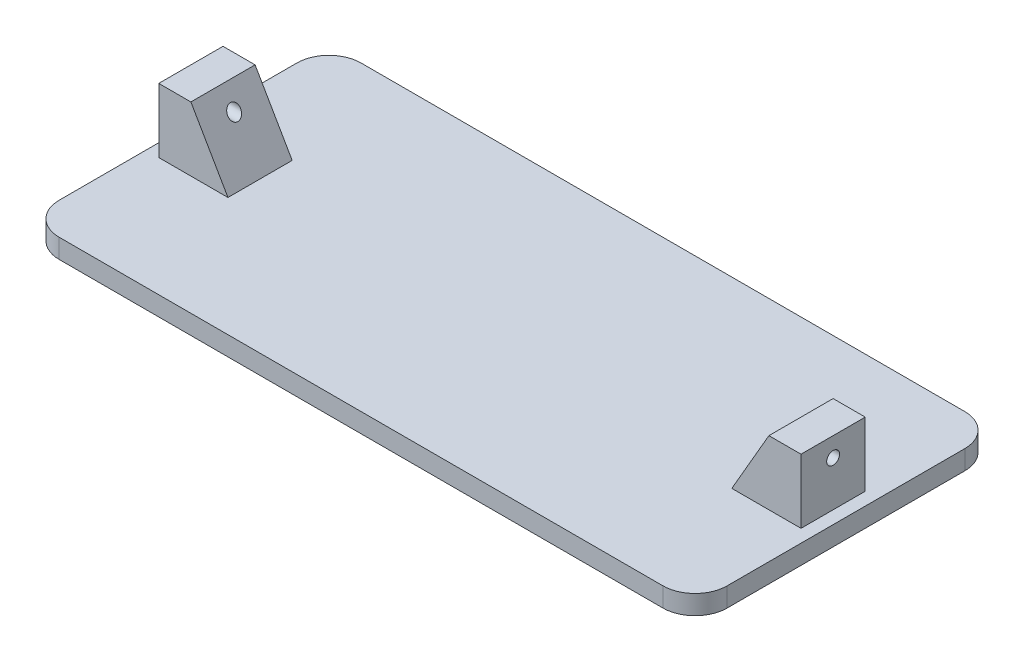
ISO-10303-21;
HEADER;
FILE_DESCRIPTION(('STEP AP214'),'2;1');
FILE_NAME('part.step','',(''),(''),'','','');
FILE_SCHEMA(('AUTOMOTIVE_DESIGN { 1 0 10303 214 1 1 1 1 }'));
ENDSEC;
DATA;
#1=APPLICATION_CONTEXT('core data for automotive mechanical design processes');
#2=APPLICATION_PROTOCOL_DEFINITION('international standard','automotive_design',2000,#1);
#3=PRODUCT_CONTEXT('',#1,'mechanical');
#4=PRODUCT('Part','Part','',(#3));
#5=PRODUCT_RELATED_PRODUCT_CATEGORY('part','',(#4));
#6=PRODUCT_DEFINITION_FORMATION('','',#4);
#7=PRODUCT_DEFINITION_CONTEXT('part definition',#1,'design');
#8=PRODUCT_DEFINITION('design','',#6,#7);
#9=PRODUCT_DEFINITION_SHAPE('','',#8);
#10=(LENGTH_UNIT() NAMED_UNIT(*) SI_UNIT(.MILLI.,.METRE.));
#11=(NAMED_UNIT(*) PLANE_ANGLE_UNIT() SI_UNIT($,.RADIAN.));
#12=(NAMED_UNIT(*) SI_UNIT($,.STERADIAN.) SOLID_ANGLE_UNIT());
#13=UNCERTAINTY_MEASURE_WITH_UNIT(LENGTH_MEASURE(1.E-05),#10,'distance_accuracy_value','');
#14=(GEOMETRIC_REPRESENTATION_CONTEXT(3) GLOBAL_UNCERTAINTY_ASSIGNED_CONTEXT((#13)) GLOBAL_UNIT_ASSIGNED_CONTEXT((#10,
#11,#12)) REPRESENTATION_CONTEXT('',''));
#15=CARTESIAN_POINT('',(0.,0.,0.));
#16=DIRECTION('',(0.,0.,1.));
#17=DIRECTION('',(1.,0.,0.));
#18=AXIS2_PLACEMENT_3D('',#15,#16,#17);
#19=CARTESIAN_POINT('',(-50.,3.,16.5));
#20=DIRECTION('',(1.,0.,0.));
#21=DIRECTION('',(0.,0.,-1.));
#22=AXIS2_PLACEMENT_3D('',#19,#20,#21);
#23=PLANE('',#22);
#24=CARTESIAN_POINT('',(-50.,10.,0.));
#25=DIRECTION('',(-1.,0.,0.));
#26=DIRECTION('',(0.,0.,1.));
#27=AXIS2_PLACEMENT_3D('',#24,#25,#26);
#28=CIRCLE('',#27,1.);
#29=CARTESIAN_POINT('',(-50.,10.,1.));
#30=VERTEX_POINT('',#29);
#31=EDGE_CURVE('E220',#30,#30,#28,.T.);
#32=ORIENTED_EDGE('',*,*,#31,.F.);
#33=EDGE_LOOP('',(#32));
#34=FACE_BOUND('',#33,.T.);
#35=DIRECTION('',(0.,0.,-1.));
#36=VECTOR('',#35,1.);
#37=CARTESIAN_POINT('',(-50.,3.,0.));
#38=LINE('',#37,#36);
#39=CARTESIAN_POINT('',(-50.,3.,5.));
#40=VERTEX_POINT('',#39);
#41=CARTESIAN_POINT('',(-50.,3.,-5.));
#42=VERTEX_POINT('',#41);
#43=EDGE_CURVE('E182',#40,#42,#38,.T.);
#44=ORIENTED_EDGE('',*,*,#43,.F.);
#45=DIRECTION('',(0.,1.,0.));
#46=VECTOR('',#45,1.);
#47=CARTESIAN_POINT('',(-50.,0.,5.));
#48=LINE('',#47,#46);
#49=CARTESIAN_POINT('',(-50.,13.,5.));
#50=VERTEX_POINT('',#49);
#51=EDGE_CURVE('E274',#40,#50,#48,.T.);
#52=ORIENTED_EDGE('',*,*,#51,.T.);
#53=DIRECTION('',(0.,0.,-1.));
#54=VECTOR('',#53,1.);
#55=CARTESIAN_POINT('',(-50.,13.,5.));
#56=LINE('',#55,#54);
#57=CARTESIAN_POINT('',(-50.,13.,-5.));
#58=VERTEX_POINT('',#57);
#59=EDGE_CURVE('E53',#50,#58,#56,.T.);
#60=ORIENTED_EDGE('',*,*,#59,.T.);
#61=DIRECTION('',(0.,1.,0.));
#62=VECTOR('',#61,1.);
#63=CARTESIAN_POINT('',(-50.,0.,-5.));
#64=LINE('',#63,#62);
#65=EDGE_CURVE('E270',#42,#58,#64,.T.);
#66=ORIENTED_EDGE('',*,*,#65,.F.);
#67=EDGE_LOOP('',(#44,#52,#60,#66));
#68=FACE_BOUND('',#67,.T.);
#69=ADVANCED_FACE('F36',(#34,#68),#23,.F.);
#70=CARTESIAN_POINT('',(50.,3.,16.5));
#71=DIRECTION('',(-1.,0.,0.));
#72=DIRECTION('',(0.,0.,1.));
#73=AXIS2_PLACEMENT_3D('',#70,#71,#72);
#74=PLANE('',#73);
#75=CARTESIAN_POINT('',(50.,10.,0.));
#76=DIRECTION('',(-1.,0.,0.));
#77=DIRECTION('',(0.,0.,1.));
#78=AXIS2_PLACEMENT_3D('',#75,#76,#77);
#79=CIRCLE('',#78,1.);
#80=CARTESIAN_POINT('',(50.,10.,1.));
#81=VERTEX_POINT('',#80);
#82=EDGE_CURVE('E232',#81,#81,#79,.T.);
#83=ORIENTED_EDGE('',*,*,#82,.T.);
#84=EDGE_LOOP('',(#83));
#85=FACE_BOUND('',#84,.T.);
#86=DIRECTION('',(0.,0.,1.));
#87=VECTOR('',#86,1.);
#88=CARTESIAN_POINT('',(50.,3.,0.));
#89=LINE('',#88,#87);
#90=CARTESIAN_POINT('',(50.,3.,-5.));
#91=VERTEX_POINT('',#90);
#92=CARTESIAN_POINT('',(50.,3.,5.));
#93=VERTEX_POINT('',#92);
#94=EDGE_CURVE('E180',#91,#93,#89,.T.);
#95=ORIENTED_EDGE('',*,*,#94,.F.);
#96=DIRECTION('',(0.,1.,0.));
#97=VECTOR('',#96,1.);
#98=CARTESIAN_POINT('',(50.,-1.38777878078144E-13,-5.));
#99=LINE('',#98,#97);
#100=CARTESIAN_POINT('',(50.,13.,-5.));
#101=VERTEX_POINT('',#100);
#102=EDGE_CURVE('E254',#91,#101,#99,.T.);
#103=ORIENTED_EDGE('',*,*,#102,.T.);
#104=DIRECTION('',(0.,0.,-1.));
#105=VECTOR('',#104,1.);
#106=CARTESIAN_POINT('',(50.,13.,5.));
#107=LINE('',#106,#105);
#108=CARTESIAN_POINT('',(50.,13.,5.));
#109=VERTEX_POINT('',#108);
#110=EDGE_CURVE('E264',#109,#101,#107,.T.);
#111=ORIENTED_EDGE('',*,*,#110,.F.);
#112=DIRECTION('',(0.,1.,0.));
#113=VECTOR('',#112,1.);
#114=CARTESIAN_POINT('',(50.,-1.38777878078144E-13,5.));
#115=LINE('',#114,#113);
#116=EDGE_CURVE('E244',#93,#109,#115,.T.);
#117=ORIENTED_EDGE('',*,*,#116,.F.);
#118=EDGE_LOOP('',(#95,#103,#111,#117));
#119=FACE_BOUND('',#118,.T.);
#120=ADVANCED_FACE('F307',(#85,#119),#74,.F.);
#121=CARTESIAN_POINT('',(45.,3.,-16.5));
#122=DIRECTION('',(0.,1.,0.));
#123=DIRECTION('',(0.,0.,1.));
#124=AXIS2_PLACEMENT_3D('',#121,#122,#123);
#125=PLANE('',#124);
#126=ORIENTED_EDGE('',*,*,#94,.T.);
#127=DIRECTION('',(-1.,0.,0.));
#128=VECTOR('',#127,1.);
#129=CARTESIAN_POINT('',(0.,3.,5.));
#130=LINE('',#129,#128);
#131=CARTESIAN_POINT('',(39.2264973081037,3.00000000000002,5.));
#132=VERTEX_POINT('',#131);
#133=EDGE_CURVE('E241',#93,#132,#130,.T.);
#134=ORIENTED_EDGE('',*,*,#133,.T.);
#135=DIRECTION('',(0.,0.,-1.));
#136=VECTOR('',#135,1.);
#137=CARTESIAN_POINT('',(39.2264973081037,3.00000000000002,5.));
#138=LINE('',#137,#136);
#139=CARTESIAN_POINT('',(39.2264973081037,3.00000000000002,-5.));
#140=VERTEX_POINT('',#139);
#141=EDGE_CURVE('E251',#132,#140,#138,.T.);
#142=ORIENTED_EDGE('',*,*,#141,.T.);
#143=DIRECTION('',(-1.,0.,0.));
#144=VECTOR('',#143,1.);
#145=CARTESIAN_POINT('',(0.,3.,-5.));
#146=LINE('',#145,#144);
#147=EDGE_CURVE('E240',#91,#140,#146,.T.);
#148=ORIENTED_EDGE('',*,*,#147,.F.);
#149=EDGE_LOOP('',(#126,#134,#142,#148));
#150=FACE_BOUND('',#149,.T.);
#151=ORIENTED_EDGE('',*,*,#43,.T.);
#152=DIRECTION('',(-1.,0.,0.));
#153=VECTOR('',#152,1.);
#154=CARTESIAN_POINT('',(0.,3.00000000000012,-5.));
#155=LINE('',#154,#153);
#156=CARTESIAN_POINT('',(-39.2264973081037,3.00000000000002,-5.));
#157=VERTEX_POINT('',#156);
#158=EDGE_CURVE('E267',#157,#42,#155,.T.);
#159=ORIENTED_EDGE('',*,*,#158,.F.);
#160=DIRECTION('',(0.,0.,-1.));
#161=VECTOR('',#160,1.);
#162=CARTESIAN_POINT('',(-39.2264973081037,3.00000000000002,5.));
#163=LINE('',#162,#161);
#164=CARTESIAN_POINT('',(-39.2264973081037,3.00000000000002,5.));
#165=VERTEX_POINT('',#164);
#166=EDGE_CURVE('E11',#165,#157,#163,.T.);
#167=ORIENTED_EDGE('',*,*,#166,.F.);
#168=DIRECTION('',(-1.,0.,0.));
#169=VECTOR('',#168,1.);
#170=CARTESIAN_POINT('',(0.,3.00000000000012,5.));
#171=LINE('',#170,#169);
#172=EDGE_CURVE('E73',#165,#40,#171,.T.);
#173=ORIENTED_EDGE('',*,*,#172,.T.);
#174=EDGE_LOOP('',(#151,#159,#167,#173));
#175=FACE_BOUND('',#174,.T.);
#176=DIRECTION('',(0.,0.,-1.));
#177=VECTOR('',#176,1.);
#178=CARTESIAN_POINT('',(-52.,3.,0.));
#179=LINE('',#178,#177);
#180=CARTESIAN_POINT('',(-52.,3.,18.5));
#181=VERTEX_POINT('',#180);
#182=CARTESIAN_POINT('',(-52.,3.,-18.5));
#183=VERTEX_POINT('',#182);
#184=EDGE_CURVE('E173',#181,#183,#179,.T.);
#185=ORIENTED_EDGE('',*,*,#184,.F.);
#186=CARTESIAN_POINT('',(-47.,3.,18.5));
#187=DIRECTION('',(0.,-1.,0.));
#188=DIRECTION('',(0.,0.,-1.));
#189=AXIS2_PLACEMENT_3D('',#186,#187,#188);
#190=CIRCLE('',#189,5.);
#191=CARTESIAN_POINT('',(-47.,3.,23.5));
#192=VERTEX_POINT('',#191);
#193=EDGE_CURVE('E166',#192,#181,#190,.T.);
#194=ORIENTED_EDGE('',*,*,#193,.F.);
#195=DIRECTION('',(1.,0.,0.));
#196=VECTOR('',#195,1.);
#197=CARTESIAN_POINT('',(0.,3.,23.5));
#198=LINE('',#197,#196);
#199=CARTESIAN_POINT('',(47.,3.,23.5));
#200=VERTEX_POINT('',#199);
#201=EDGE_CURVE('E195',#192,#200,#198,.T.);
#202=ORIENTED_EDGE('',*,*,#201,.T.);
#203=CARTESIAN_POINT('',(47.,3.,18.5));
#204=DIRECTION('',(0.,-1.,0.));
#205=DIRECTION('',(0.,0.,-1.));
#206=AXIS2_PLACEMENT_3D('',#203,#204,#205);
#207=CIRCLE('',#206,5.);
#208=CARTESIAN_POINT('',(52.,3.,18.5));
#209=VERTEX_POINT('',#208);
#210=EDGE_CURVE('E192',#209,#200,#207,.T.);
#211=ORIENTED_EDGE('',*,*,#210,.F.);
#212=DIRECTION('',(0.,0.,1.));
#213=VECTOR('',#212,1.);
#214=CARTESIAN_POINT('',(52.,3.,0.));
#215=LINE('',#214,#213);
#216=CARTESIAN_POINT('',(52.,3.,-18.5));
#217=VERTEX_POINT('',#216);
#218=EDGE_CURVE('E189',#217,#209,#215,.T.);
#219=ORIENTED_EDGE('',*,*,#218,.F.);
#220=CARTESIAN_POINT('',(47.,3.,-18.5));
#221=DIRECTION('',(0.,-1.,0.));
#222=DIRECTION('',(0.,0.,-1.));
#223=AXIS2_PLACEMENT_3D('',#220,#221,#222);
#224=CIRCLE('',#223,5.);
#225=CARTESIAN_POINT('',(47.,3.,-23.5));
#226=VERTEX_POINT('',#225);
#227=EDGE_CURVE('E187',#217,#226,#224,.F.);
#228=ORIENTED_EDGE('',*,*,#227,.T.);
#229=DIRECTION('',(1.,0.,0.));
#230=VECTOR('',#229,1.);
#231=CARTESIAN_POINT('',(0.,3.,-23.5));
#232=LINE('',#231,#230);
#233=CARTESIAN_POINT('',(-47.,3.,-23.5));
#234=VERTEX_POINT('',#233);
#235=EDGE_CURVE('E176',#234,#226,#232,.T.);
#236=ORIENTED_EDGE('',*,*,#235,.F.);
#237=CARTESIAN_POINT('',(-47.,3.,-18.5));
#238=DIRECTION('',(0.,-1.,0.));
#239=DIRECTION('',(0.,0.,-1.));
#240=AXIS2_PLACEMENT_3D('',#237,#238,#239);
#241=CIRCLE('',#240,5.);
#242=EDGE_CURVE('E158',#183,#234,#241,.T.);
#243=ORIENTED_EDGE('',*,*,#242,.F.);
#244=EDGE_LOOP('',(#185,#194,#202,#211,#219,#228,#236,#243));
#245=FACE_BOUND('',#244,.T.);
#246=ADVANCED_FACE('F171',(#150,#175,#245),#125,.T.);
#247=CARTESIAN_POINT('',(-28.1208348754009,-16.2355715851499,5.));
#248=DIRECTION('',(0.866025403784436,0.500000000000004,0.));
#249=DIRECTION('',(-0.500000000000004,0.866025403784436,0.));
#250=AXIS2_PLACEMENT_3D('',#247,#248,#249);
#251=PLANE('',#250);
#252=CARTESIAN_POINT('',(-43.2679491924311,10.,0.));
#253=DIRECTION('',(0.866025403784436,0.500000000000004,0.));
#254=DIRECTION('',(-0.500000000000004,0.866025403784436,0.));
#255=AXIS2_PLACEMENT_3D('',#252,#253,#254);
#256=ELLIPSE('',#255,1.15470053837926,1.);
#257=CARTESIAN_POINT('',(-43.8452994616207,11.,0.));
#258=VERTEX_POINT('',#257);
#259=EDGE_CURVE('E237',#258,#258,#256,.T.);
#260=ORIENTED_EDGE('',*,*,#259,.F.);
#261=EDGE_LOOP('',(#260));
#262=FACE_BOUND('',#261,.T.);
#263=DIRECTION('',(0.500000000000004,-0.866025403784436,0.));
#264=VECTOR('',#263,1.);
#265=CARTESIAN_POINT('',(-28.1208348754009,-16.2355715851499,-5.));
#266=LINE('',#265,#264);
#267=CARTESIAN_POINT('',(-45.,13.,-5.));
#268=VERTEX_POINT('',#267);
#269=EDGE_CURVE('E278',#268,#157,#266,.T.);
#270=ORIENTED_EDGE('',*,*,#269,.F.);
#271=DIRECTION('',(0.,0.,-1.));
#272=VECTOR('',#271,1.);
#273=CARTESIAN_POINT('',(-45.,13.,5.));
#274=LINE('',#273,#272);
#275=CARTESIAN_POINT('',(-45.,13.,5.));
#276=VERTEX_POINT('',#275);
#277=EDGE_CURVE('E45',#276,#268,#274,.T.);
#278=ORIENTED_EDGE('',*,*,#277,.F.);
#279=DIRECTION('',(0.500000000000004,-0.866025403784436,0.));
#280=VECTOR('',#279,1.);
#281=CARTESIAN_POINT('',(-28.1208348754009,-16.2355715851499,5.));
#282=LINE('',#281,#280);
#283=EDGE_CURVE('E269',#276,#165,#282,.T.);
#284=ORIENTED_EDGE('',*,*,#283,.T.);
#285=ORIENTED_EDGE('',*,*,#166,.T.);
#286=EDGE_LOOP('',(#270,#278,#284,#285));
#287=FACE_BOUND('',#286,.T.);
#288=ADVANCED_FACE('F294',(#262,#287),#251,.T.);
#289=CARTESIAN_POINT('',(0.,13.,5.));
#290=DIRECTION('',(0.,1.,0.));
#291=DIRECTION('',(0.,0.,1.));
#292=AXIS2_PLACEMENT_3D('',#289,#290,#291);
#293=PLANE('',#292);
#294=DIRECTION('',(1.,0.,0.));
#295=VECTOR('',#294,1.);
#296=CARTESIAN_POINT('',(0.,13.,-5.));
#297=LINE('',#296,#295);
#298=EDGE_CURVE('E281',#58,#268,#297,.T.);
#299=ORIENTED_EDGE('',*,*,#298,.F.);
#300=ORIENTED_EDGE('',*,*,#59,.F.);
#301=DIRECTION('',(1.,0.,0.));
#302=VECTOR('',#301,1.);
#303=CARTESIAN_POINT('',(0.,13.,5.));
#304=LINE('',#303,#302);
#305=EDGE_CURVE('E272',#50,#276,#304,.T.);
#306=ORIENTED_EDGE('',*,*,#305,.T.);
#307=ORIENTED_EDGE('',*,*,#277,.T.);
#308=EDGE_LOOP('',(#299,#300,#306,#307));
#309=FACE_BOUND('',#308,.T.);
#310=ADVANCED_FACE('F295',(#309),#293,.T.);
#311=CARTESIAN_POINT('',(0.,0.,5.));
#312=DIRECTION('',(0.,0.,1.));
#313=DIRECTION('',(1.,0.,0.));
#314=AXIS2_PLACEMENT_3D('',#311,#312,#313);
#315=PLANE('',#314);
#316=ORIENTED_EDGE('',*,*,#172,.F.);
#317=ORIENTED_EDGE('',*,*,#283,.F.);
#318=ORIENTED_EDGE('',*,*,#305,.F.);
#319=ORIENTED_EDGE('',*,*,#51,.F.);
#320=EDGE_LOOP('',(#316,#317,#318,#319));
#321=FACE_BOUND('',#320,.T.);
#322=ADVANCED_FACE('F291',(#321),#315,.T.);
#323=CARTESIAN_POINT('',(0.,0.,-5.));
#324=DIRECTION('',(0.,0.,1.));
#325=DIRECTION('',(1.,0.,0.));
#326=AXIS2_PLACEMENT_3D('',#323,#324,#325);
#327=PLANE('',#326);
#328=ORIENTED_EDGE('',*,*,#158,.T.);
#329=ORIENTED_EDGE('',*,*,#65,.T.);
#330=ORIENTED_EDGE('',*,*,#298,.T.);
#331=ORIENTED_EDGE('',*,*,#269,.T.);
#332=EDGE_LOOP('',(#328,#329,#330,#331));
#333=FACE_BOUND('',#332,.T.);
#334=ADVANCED_FACE('F288',(#333),#327,.F.);
#335=CARTESIAN_POINT('',(0.,13.,5.));
#336=DIRECTION('',(0.,-1.,0.));
#337=DIRECTION('',(1.,0.,0.));
#338=AXIS2_PLACEMENT_3D('',#335,#336,#337);
#339=PLANE('',#338);
#340=DIRECTION('',(-1.,0.,0.));
#341=VECTOR('',#340,1.);
#342=CARTESIAN_POINT('',(0.,13.,-5.));
#343=LINE('',#342,#341);
#344=CARTESIAN_POINT('',(45.,13.,-5.));
#345=VERTEX_POINT('',#344);
#346=EDGE_CURVE('E256',#101,#345,#343,.T.);
#347=ORIENTED_EDGE('',*,*,#346,.T.);
#348=DIRECTION('',(0.,0.,-1.));
#349=VECTOR('',#348,1.);
#350=CARTESIAN_POINT('',(45.,13.,5.));
#351=LINE('',#350,#349);
#352=CARTESIAN_POINT('',(45.,13.,5.));
#353=VERTEX_POINT('',#352);
#354=EDGE_CURVE('E261',#353,#345,#351,.T.);
#355=ORIENTED_EDGE('',*,*,#354,.F.);
#356=DIRECTION('',(-1.,0.,0.));
#357=VECTOR('',#356,1.);
#358=CARTESIAN_POINT('',(0.,13.,5.));
#359=LINE('',#358,#357);
#360=EDGE_CURVE('E247',#109,#353,#359,.T.);
#361=ORIENTED_EDGE('',*,*,#360,.F.);
#362=ORIENTED_EDGE('',*,*,#110,.T.);
#363=EDGE_LOOP('',(#347,#355,#361,#362));
#364=FACE_BOUND('',#363,.T.);
#365=ADVANCED_FACE('F340',(#364),#339,.F.);
#366=CARTESIAN_POINT('',(28.120834875401,-16.2355715851499,5.));
#367=DIRECTION('',(0.866025403784436,-0.500000000000004,0.));
#368=DIRECTION('',(0.500000000000004,0.866025403784436,0.));
#369=AXIS2_PLACEMENT_3D('',#366,#367,#368);
#370=PLANE('',#369);
#371=CARTESIAN_POINT('',(43.2679491924311,10.,0.));
#372=DIRECTION('',(0.866025403784436,-0.500000000000004,0.));
#373=DIRECTION('',(-0.500000000000004,-0.866025403784436,0.));
#374=AXIS2_PLACEMENT_3D('',#371,#372,#373);
#375=ELLIPSE('',#374,1.15470053837926,1.);
#376=CARTESIAN_POINT('',(42.6905989232415,9.,0.));
#377=VERTEX_POINT('',#376);
#378=EDGE_CURVE('E39',#377,#377,#375,.T.);
#379=ORIENTED_EDGE('',*,*,#378,.T.);
#380=EDGE_LOOP('',(#379));
#381=FACE_BOUND('',#380,.T.);
#382=DIRECTION('',(-0.500000000000004,-0.866025403784436,0.));
#383=VECTOR('',#382,1.);
#384=CARTESIAN_POINT('',(28.120834875401,-16.2355715851499,-5.));
#385=LINE('',#384,#383);
#386=EDGE_CURVE('E245',#345,#140,#385,.T.);
#387=ORIENTED_EDGE('',*,*,#386,.T.);
#388=ORIENTED_EDGE('',*,*,#141,.F.);
#389=DIRECTION('',(-0.500000000000004,-0.866025403784436,0.));
#390=VECTOR('',#389,1.);
#391=CARTESIAN_POINT('',(28.120834875401,-16.2355715851499,5.));
#392=LINE('',#391,#390);
#393=EDGE_CURVE('E249',#353,#132,#392,.T.);
#394=ORIENTED_EDGE('',*,*,#393,.F.);
#395=ORIENTED_EDGE('',*,*,#354,.T.);
#396=EDGE_LOOP('',(#387,#388,#394,#395));
#397=FACE_BOUND('',#396,.T.);
#398=ADVANCED_FACE('F333',(#381,#397),#370,.F.);
#399=CARTESIAN_POINT('',(0.,0.,5.));
#400=DIRECTION('',(0.,0.,1.));
#401=DIRECTION('',(1.,0.,0.));
#402=AXIS2_PLACEMENT_3D('',#399,#400,#401);
#403=PLANE('',#402);
#404=ORIENTED_EDGE('',*,*,#133,.F.);
#405=ORIENTED_EDGE('',*,*,#116,.T.);
#406=ORIENTED_EDGE('',*,*,#360,.T.);
#407=ORIENTED_EDGE('',*,*,#393,.T.);
#408=EDGE_LOOP('',(#404,#405,#406,#407));
#409=FACE_BOUND('',#408,.T.);
#410=ADVANCED_FACE('F330',(#409),#403,.T.);
#411=CARTESIAN_POINT('',(0.,0.,-5.));
#412=DIRECTION('',(0.,0.,1.));
#413=DIRECTION('',(1.,0.,0.));
#414=AXIS2_PLACEMENT_3D('',#411,#412,#413);
#415=PLANE('',#414);
#416=ORIENTED_EDGE('',*,*,#147,.T.);
#417=ORIENTED_EDGE('',*,*,#386,.F.);
#418=ORIENTED_EDGE('',*,*,#346,.F.);
#419=ORIENTED_EDGE('',*,*,#102,.F.);
#420=EDGE_LOOP('',(#416,#417,#418,#419));
#421=FACE_BOUND('',#420,.T.);
#422=ADVANCED_FACE('F326',(#421),#415,.F.);
#423=CARTESIAN_POINT('',(50.,10.,0.));
#424=DIRECTION('',(-1.,0.,0.));
#425=DIRECTION('',(0.,0.,1.));
#426=AXIS2_PLACEMENT_3D('',#423,#424,#425);
#427=CYLINDRICAL_SURFACE('',#426,1.);
#428=ORIENTED_EDGE('',*,*,#82,.F.);
#429=EDGE_LOOP('',(#428));
#430=FACE_BOUND('',#429,.T.);
#431=ORIENTED_EDGE('',*,*,#378,.F.);
#432=EDGE_LOOP('',(#431));
#433=FACE_BOUND('',#432,.T.);
#434=ADVANCED_FACE('F317',(#430,#433),#427,.F.);
#435=ORIENTED_EDGE('',*,*,#259,.T.);
#436=EDGE_LOOP('',(#435));
#437=FACE_BOUND('',#436,.T.);
#438=ORIENTED_EDGE('',*,*,#31,.T.);
#439=EDGE_LOOP('',(#438));
#440=FACE_BOUND('',#439,.T.);
#441=ADVANCED_FACE('F315',(#437,#440),#427,.F.);
#442=CARTESIAN_POINT('',(-52.,3.,0.));
#443=DIRECTION('',(-1.,0.,0.));
#444=DIRECTION('',(0.,0.,1.));
#445=AXIS2_PLACEMENT_3D('',#442,#443,#444);
#446=PLANE('',#445);
#447=DIRECTION('',(0.,0.,-1.));
#448=VECTOR('',#447,1.);
#449=CARTESIAN_POINT('',(-52.,0.,0.));
#450=LINE('',#449,#448);
#451=CARTESIAN_POINT('',(-52.,0.,18.5));
#452=VERTEX_POINT('',#451);
#453=CARTESIAN_POINT('',(-52.,0.,-18.5));
#454=VERTEX_POINT('',#453);
#455=EDGE_CURVE('E198',#452,#454,#450,.T.);
#456=ORIENTED_EDGE('',*,*,#455,.F.);
#457=DIRECTION('',(0.,-1.,0.));
#458=VECTOR('',#457,1.);
#459=CARTESIAN_POINT('',(-52.,3.,18.5));
#460=LINE('',#459,#458);
#461=EDGE_CURVE('E179',#181,#452,#460,.T.);
#462=ORIENTED_EDGE('',*,*,#461,.F.);
#463=ORIENTED_EDGE('',*,*,#184,.T.);
#464=DIRECTION('',(0.,-1.,0.));
#465=VECTOR('',#464,1.);
#466=CARTESIAN_POINT('',(-52.,3.,-18.5));
#467=LINE('',#466,#465);
#468=EDGE_CURVE('E155',#183,#454,#467,.T.);
#469=ORIENTED_EDGE('',*,*,#468,.T.);
#470=EDGE_LOOP('',(#456,#462,#463,#469));
#471=FACE_BOUND('',#470,.T.);
#472=ADVANCED_FACE('F178',(#471),#446,.T.);
#473=CARTESIAN_POINT('',(-47.,3.,18.5));
#474=DIRECTION('',(0.,-1.,0.));
#475=DIRECTION('',(0.,0.,-1.));
#476=AXIS2_PLACEMENT_3D('',#473,#474,#475);
#477=CYLINDRICAL_SURFACE('',#476,5.);
#478=CARTESIAN_POINT('',(-47.,0.,18.5));
#479=DIRECTION('',(0.,-1.,0.));
#480=DIRECTION('',(0.,0.,-1.));
#481=AXIS2_PLACEMENT_3D('',#478,#479,#480);
#482=CIRCLE('',#481,5.);
#483=CARTESIAN_POINT('',(-47.,0.,23.5));
#484=VERTEX_POINT('',#483);
#485=EDGE_CURVE('E216',#484,#452,#482,.T.);
#486=ORIENTED_EDGE('',*,*,#485,.F.);
#487=DIRECTION('',(0.,-1.,0.));
#488=VECTOR('',#487,1.);
#489=CARTESIAN_POINT('',(-47.,3.,23.5));
#490=LINE('',#489,#488);
#491=EDGE_CURVE('E221',#192,#484,#490,.T.);
#492=ORIENTED_EDGE('',*,*,#491,.F.);
#493=ORIENTED_EDGE('',*,*,#193,.T.);
#494=ORIENTED_EDGE('',*,*,#461,.T.);
#495=EDGE_LOOP('',(#486,#492,#493,#494));
#496=FACE_BOUND('',#495,.T.);
#497=ADVANCED_FACE('F324',(#496),#477,.T.);
#498=CARTESIAN_POINT('',(0.,3.,23.5));
#499=DIRECTION('',(0.,0.,-1.));
#500=DIRECTION('',(-1.,0.,0.));
#501=AXIS2_PLACEMENT_3D('',#498,#499,#500);
#502=PLANE('',#501);
#503=DIRECTION('',(1.,0.,0.));
#504=VECTOR('',#503,1.);
#505=CARTESIAN_POINT('',(0.,0.,23.5));
#506=LINE('',#505,#504);
#507=CARTESIAN_POINT('',(47.,0.,23.5));
#508=VERTEX_POINT('',#507);
#509=EDGE_CURVE('E213',#484,#508,#506,.T.);
#510=ORIENTED_EDGE('',*,*,#509,.T.);
#511=DIRECTION('',(0.,-1.,0.));
#512=VECTOR('',#511,1.);
#513=CARTESIAN_POINT('',(47.,3.,23.5));
#514=LINE('',#513,#512);
#515=EDGE_CURVE('E223',#200,#508,#514,.T.);
#516=ORIENTED_EDGE('',*,*,#515,.F.);
#517=ORIENTED_EDGE('',*,*,#201,.F.);
#518=ORIENTED_EDGE('',*,*,#491,.T.);
#519=EDGE_LOOP('',(#510,#516,#517,#518));
#520=FACE_BOUND('',#519,.T.);
#521=ADVANCED_FACE('F485',(#520),#502,.F.);
#522=CARTESIAN_POINT('',(47.,3.,18.5));
#523=DIRECTION('',(0.,-1.,0.));
#524=DIRECTION('',(0.,0.,-1.));
#525=AXIS2_PLACEMENT_3D('',#522,#523,#524);
#526=CYLINDRICAL_SURFACE('',#525,5.);
#527=CARTESIAN_POINT('',(47.,0.,18.5));
#528=DIRECTION('',(0.,-1.,0.));
#529=DIRECTION('',(0.,0.,-1.));
#530=AXIS2_PLACEMENT_3D('',#527,#528,#529);
#531=CIRCLE('',#530,5.);
#532=CARTESIAN_POINT('',(52.,0.,18.5));
#533=VERTEX_POINT('',#532);
#534=EDGE_CURVE('E210',#533,#508,#531,.T.);
#535=ORIENTED_EDGE('',*,*,#534,.F.);
#536=DIRECTION('',(0.,-1.,0.));
#537=VECTOR('',#536,1.);
#538=CARTESIAN_POINT('',(52.,3.,18.5));
#539=LINE('',#538,#537);
#540=EDGE_CURVE('E225',#209,#533,#539,.T.);
#541=ORIENTED_EDGE('',*,*,#540,.F.);
#542=ORIENTED_EDGE('',*,*,#210,.T.);
#543=ORIENTED_EDGE('',*,*,#515,.T.);
#544=EDGE_LOOP('',(#535,#541,#542,#543));
#545=FACE_BOUND('',#544,.T.);
#546=ADVANCED_FACE('F474',(#545),#526,.T.);
#547=CARTESIAN_POINT('',(52.,3.,0.));
#548=DIRECTION('',(1.,0.,0.));
#549=DIRECTION('',(0.,0.,-1.));
#550=AXIS2_PLACEMENT_3D('',#547,#548,#549);
#551=PLANE('',#550);
#552=DIRECTION('',(0.,0.,1.));
#553=VECTOR('',#552,1.);
#554=CARTESIAN_POINT('',(52.,0.,0.));
#555=LINE('',#554,#553);
#556=CARTESIAN_POINT('',(52.,0.,-18.5));
#557=VERTEX_POINT('',#556);
#558=EDGE_CURVE('E207',#557,#533,#555,.T.);
#559=ORIENTED_EDGE('',*,*,#558,.F.);
#560=DIRECTION('',(0.,-1.,0.));
#561=VECTOR('',#560,1.);
#562=CARTESIAN_POINT('',(52.,3.,-18.5));
#563=LINE('',#562,#561);
#564=EDGE_CURVE('E227',#217,#557,#563,.T.);
#565=ORIENTED_EDGE('',*,*,#564,.F.);
#566=ORIENTED_EDGE('',*,*,#218,.T.);
#567=ORIENTED_EDGE('',*,*,#540,.T.);
#568=EDGE_LOOP('',(#559,#565,#566,#567));
#569=FACE_BOUND('',#568,.T.);
#570=ADVANCED_FACE('F464',(#569),#551,.T.);
#571=CARTESIAN_POINT('',(47.,3.,-18.5));
#572=DIRECTION('',(0.,-1.,0.));
#573=DIRECTION('',(0.,0.,-1.));
#574=AXIS2_PLACEMENT_3D('',#571,#572,#573);
#575=CYLINDRICAL_SURFACE('',#574,5.);
#576=CARTESIAN_POINT('',(47.,0.,-18.5));
#577=DIRECTION('',(0.,-1.,0.));
#578=DIRECTION('',(0.,0.,-1.));
#579=AXIS2_PLACEMENT_3D('',#576,#577,#578);
#580=CIRCLE('',#579,5.);
#581=CARTESIAN_POINT('',(47.,0.,-23.5));
#582=VERTEX_POINT('',#581);
#583=EDGE_CURVE('E204',#557,#582,#580,.F.);
#584=ORIENTED_EDGE('',*,*,#583,.T.);
#585=DIRECTION('',(0.,-1.,0.));
#586=VECTOR('',#585,1.);
#587=CARTESIAN_POINT('',(47.,3.,-23.5));
#588=LINE('',#587,#586);
#589=EDGE_CURVE('E229',#226,#582,#588,.T.);
#590=ORIENTED_EDGE('',*,*,#589,.F.);
#591=ORIENTED_EDGE('',*,*,#227,.F.);
#592=ORIENTED_EDGE('',*,*,#564,.T.);
#593=EDGE_LOOP('',(#584,#590,#591,#592));
#594=FACE_BOUND('',#593,.T.);
#595=ADVANCED_FACE('F451',(#594),#575,.T.);
#596=CARTESIAN_POINT('',(0.,3.,-23.5));
#597=DIRECTION('',(0.,0.,-1.));
#598=DIRECTION('',(-1.,0.,0.));
#599=AXIS2_PLACEMENT_3D('',#596,#597,#598);
#600=PLANE('',#599);
#601=DIRECTION('',(1.,0.,0.));
#602=VECTOR('',#601,1.);
#603=CARTESIAN_POINT('',(0.,0.,-23.5));
#604=LINE('',#603,#602);
#605=CARTESIAN_POINT('',(-47.,0.,-23.5));
#606=VERTEX_POINT('',#605);
#607=EDGE_CURVE('E201',#606,#582,#604,.T.);
#608=ORIENTED_EDGE('',*,*,#607,.F.);
#609=DIRECTION('',(0.,-1.,0.));
#610=VECTOR('',#609,1.);
#611=CARTESIAN_POINT('',(-47.,3.,-23.5));
#612=LINE('',#611,#610);
#613=EDGE_CURVE('E165',#234,#606,#612,.T.);
#614=ORIENTED_EDGE('',*,*,#613,.F.);
#615=ORIENTED_EDGE('',*,*,#235,.T.);
#616=ORIENTED_EDGE('',*,*,#589,.T.);
#617=EDGE_LOOP('',(#608,#614,#615,#616));
#618=FACE_BOUND('',#617,.T.);
#619=ADVANCED_FACE('F444',(#618),#600,.T.);
#620=CARTESIAN_POINT('',(-47.,3.,-18.5));
#621=DIRECTION('',(0.,-1.,0.));
#622=DIRECTION('',(0.,0.,-1.));
#623=AXIS2_PLACEMENT_3D('',#620,#621,#622);
#624=CYLINDRICAL_SURFACE('',#623,5.);
#625=CARTESIAN_POINT('',(-47.,0.,-18.5));
#626=DIRECTION('',(0.,-1.,0.));
#627=DIRECTION('',(0.,0.,-1.));
#628=AXIS2_PLACEMENT_3D('',#625,#626,#627);
#629=CIRCLE('',#628,5.);
#630=EDGE_CURVE('E160',#454,#606,#629,.T.);
#631=ORIENTED_EDGE('',*,*,#630,.F.);
#632=ORIENTED_EDGE('',*,*,#468,.F.);
#633=ORIENTED_EDGE('',*,*,#242,.T.);
#634=ORIENTED_EDGE('',*,*,#613,.T.);
#635=EDGE_LOOP('',(#631,#632,#633,#634));
#636=FACE_BOUND('',#635,.T.);
#637=ADVANCED_FACE('F157',(#636),#624,.T.);
#638=CARTESIAN_POINT('',(45.,0.,-16.5));
#639=DIRECTION('',(0.,1.,0.));
#640=DIRECTION('',(0.,0.,1.));
#641=AXIS2_PLACEMENT_3D('',#638,#639,#640);
#642=PLANE('',#641);
#643=ORIENTED_EDGE('',*,*,#455,.T.);
#644=ORIENTED_EDGE('',*,*,#630,.T.);
#645=ORIENTED_EDGE('',*,*,#607,.T.);
#646=ORIENTED_EDGE('',*,*,#583,.F.);
#647=ORIENTED_EDGE('',*,*,#558,.T.);
#648=ORIENTED_EDGE('',*,*,#534,.T.);
#649=ORIENTED_EDGE('',*,*,#509,.F.);
#650=ORIENTED_EDGE('',*,*,#485,.T.);
#651=EDGE_LOOP('',(#643,#644,#645,#646,#647,#648,#649,#650));
#652=FACE_BOUND('',#651,.T.);
#653=ADVANCED_FACE('F425',(#652),#642,.F.);
#654=CLOSED_SHELL('',(#69,#120,#246,#288,#310,#322,#334,#365,#398,#410,#422,#434,#441,#472,#497,
#521,#546,#570,#595,#619,#637,#653));
#655=MANIFOLD_SOLID_BREP('B2',#654);
#656=ADVANCED_BREP_SHAPE_REPRESENTATION('',(#18,#655),#14);
#657=SHAPE_DEFINITION_REPRESENTATION(#9,#656);
ENDSEC;
END-ISO-10303-21;
